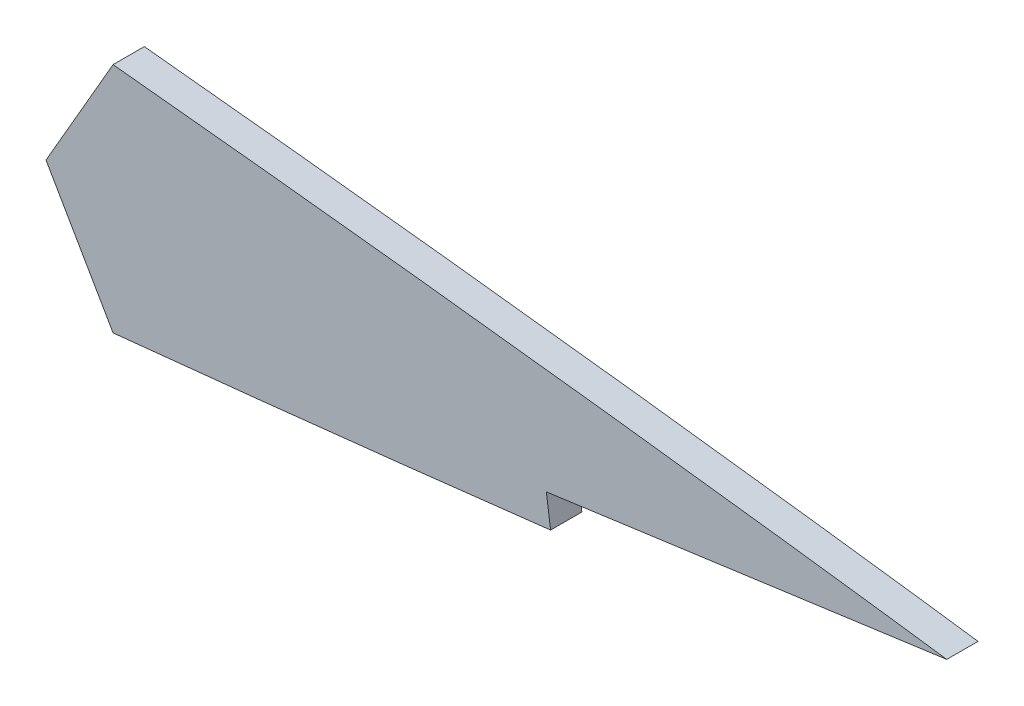
ISO-10303-21;
HEADER;
FILE_DESCRIPTION(('STEP AP214'),'2;1');
FILE_NAME('part.step','',(''),(''),'','','');
FILE_SCHEMA(('AUTOMOTIVE_DESIGN { 1 0 10303 214 1 1 1 1 }'));
ENDSEC;
DATA;
#1=APPLICATION_CONTEXT('core data for automotive mechanical design processes');
#2=APPLICATION_PROTOCOL_DEFINITION('international standard','automotive_design',2000,#1);
#3=PRODUCT_CONTEXT('',#1,'mechanical');
#4=PRODUCT('Part','Part','',(#3));
#5=PRODUCT_RELATED_PRODUCT_CATEGORY('part','',(#4));
#6=PRODUCT_DEFINITION_FORMATION('','',#4);
#7=PRODUCT_DEFINITION_CONTEXT('part definition',#1,'design');
#8=PRODUCT_DEFINITION('design','',#6,#7);
#9=PRODUCT_DEFINITION_SHAPE('','',#8);
#10=(LENGTH_UNIT() NAMED_UNIT(*) SI_UNIT(.MILLI.,.METRE.));
#11=(NAMED_UNIT(*) PLANE_ANGLE_UNIT() SI_UNIT($,.RADIAN.));
#12=(NAMED_UNIT(*) SI_UNIT($,.STERADIAN.) SOLID_ANGLE_UNIT());
#13=UNCERTAINTY_MEASURE_WITH_UNIT(LENGTH_MEASURE(1.E-05),#10,'distance_accuracy_value','');
#14=(GEOMETRIC_REPRESENTATION_CONTEXT(3) GLOBAL_UNCERTAINTY_ASSIGNED_CONTEXT((#13)) GLOBAL_UNIT_ASSIGNED_CONTEXT((#10,
#11,#12)) REPRESENTATION_CONTEXT('',''));
#15=CARTESIAN_POINT('',(0.,0.,0.));
#16=DIRECTION('',(0.,0.,1.));
#17=DIRECTION('',(1.,0.,0.));
#18=AXIS2_PLACEMENT_3D('',#15,#16,#17);
#19=CARTESIAN_POINT('',(0.,0.,3.175));
#20=CARTESIAN_POINT('',(0.11598553480206,-0.824823436018305,3.175));
#21=CARTESIAN_POINT('',(0.364862543708602,-2.59469577382463,3.175));
#22=CARTESIAN_POINT('',(2.22969317329404,-4.97424741823603,3.175));
#23=CARTESIAN_POINT('',(4.98137123964954,-7.17476356535342,3.175));
#24=CARTESIAN_POINT('',(8.77294159508804,-9.24947970106576,3.175));
#25=CARTESIAN_POINT('',(13.5435191774407,-11.2024906751345,3.175));
#26=CARTESIAN_POINT('',(19.2974960213887,-13.0205834501878,3.175));
#27=CARTESIAN_POINT('',(25.9988683661861,-14.6868250170778,3.175));
#28=CARTESIAN_POINT('',(33.6118170782071,-16.1849674426803,3.175));
#29=CARTESIAN_POINT('',(42.0909888876184,-17.4980708306289,3.175));
#30=CARTESIAN_POINT('',(51.3852334657117,-18.6124209383249,3.175));
#31=CARTESIAN_POINT('',(61.4378279271614,-19.5185362955799,3.175));
#32=CARTESIAN_POINT('',(72.1872792194382,-20.2093401026352,3.175));
#33=CARTESIAN_POINT('',(83.5675143626099,-20.6827537764749,3.175));
#34=CARTESIAN_POINT('',(95.5084877266096,-20.9400156934708,3.175));
#35=CARTESIAN_POINT('',(107.936696619066,-20.9876471619784,3.175));
#36=CARTESIAN_POINT('',(120.775518049418,-20.8348485852232,3.175));
#37=CARTESIAN_POINT('',(133.946062727329,-20.4937461228791,3.175));
#38=CARTESIAN_POINT('',(147.366939386786,-19.981000511003,3.175));
#39=CARTESIAN_POINT('',(160.955791029869,-19.3133394364877,3.175));
#40=CARTESIAN_POINT('',(174.628693343563,-18.508566702671,3.175));
#41=CARTESIAN_POINT('',(188.301472832485,-17.5870138793066,3.175));
#42=CARTESIAN_POINT('',(201.889886046072,-16.5679498364445,3.175));
#43=CARTESIAN_POINT('',(215.310032455186,-15.470294327225,3.175));
#44=CARTESIAN_POINT('',(228.479451099162,-14.3119446099029,3.175));
#45=CARTESIAN_POINT('',(241.316804274559,-13.1122664299753,3.175));
#46=CARTESIAN_POINT('',(253.743033604296,-11.887008330919,3.175));
#47=CARTESIAN_POINT('',(265.681494766393,-10.6533719228195,3.175));
#48=CARTESIAN_POINT('',(277.058607360279,-9.42727111028594,3.175));
#49=CARTESIAN_POINT('',(287.804163994382,-8.22396630077346,3.175));
#50=CARTESIAN_POINT('',(297.851820226782,-7.0580399063066,3.175));
#51=CARTESIAN_POINT('',(307.139892382437,-5.94572982998584,3.175));
#52=CARTESIAN_POINT('',(315.610665982134,-4.89963732621521,3.175));
#53=CARTESIAN_POINT('',(323.213152208341,-3.93775159154104,3.175));
#54=CARTESIAN_POINT('',(329.896669994559,-3.064968775534,3.175));
#55=CARTESIAN_POINT('',(335.63166517205,-2.31918990164751,3.175));
#56=CARTESIAN_POINT('',(340.34887380594,-1.64076533548796,3.175));
#57=CARTESIAN_POINT('',(344.110866429769,-1.23133082569655,3.175));
#58=CARTESIAN_POINT('',(346.670763267733,-0.635287814967107,3.175));
#59=CARTESIAN_POINT('',(348.546486747565,-0.815947966453894,3.175));
#60=CARTESIAN_POINT('',(349.081845345648,-0.195028946210061,3.175));
#61=CARTESIAN_POINT('',(349.25,0.,3.175));
#62=B_SPLINE_CURVE_WITH_KNOTS('',3,(#19,#20,#21,#22,#23,#24,#25,#26,#27,#28,#29,#30,#31,#32,#33,
#34,#35,#36,#37,#38,#39,#40,#41,#42,#43,#44,#45,#46,#47,#48,#49,#50,#51,#52,#53,#54,#55,#56,#57,
#58,#59,#60,#61),.UNSPECIFIED.,.F.,.F.,(4,1,1,1,1,1,1,1,1,1,1,1,1,1,1,1,1,1,1,1,1,1,1,1,1,1,1,1,
1,1,1,1,1,1,1,1,1,1,1,1,4),(0.,0.00690887819095132,0.014824787780603,0.0245786747262124,
0.0365868011412138,0.0510270804082164,0.0679537271803132,0.0873481546665464,0.109150934661929,
0.133267944172764,0.159584673072264,0.187963463690011,0.218251704826384,0.250281930400473,
0.283870156733695,0.318821997747217,0.354933688380441,0.391987367731552,0.429762919657396,
0.468028540529623,0.506552783072523,0.545097780862577,0.583424682124698,0.621298850837664,
0.658483139040777,0.694749649104267,0.72987052691746,0.763629321442605,0.795816346106627,
0.826229711631338,0.85468110230924,0.880993609524026,0.90500122422466,0.92655519067439,
0.945518651994912,0.961773354231409,0.975215057817464,0.985759966117311,0.993340110835715,
0.997908147241042,1.),.UNSPECIFIED.);
#63=DIRECTION('',(0.,0.,-1.));
#64=VECTOR('',#63,1.);
#65=SURFACE_OF_LINEAR_EXTRUSION('',#62,#64);
#66=CARTESIAN_POINT('',(254.465257242825,-11.8043718112123,3.175));
#67=VERTEX_POINT('',#66);
#68=CARTESIAN_POINT('',(298.924272590697,-6.92539967977461,3.175));
#69=VERTEX_POINT('',#68);
#70=EDGE_CURVE('E112',#67,#69,#62,.T.);
#71=ORIENTED_EDGE('',*,*,#70,.F.);
#72=DIRECTION('',(0.,0.,1.));
#73=VECTOR('',#72,1.);
#74=CARTESIAN_POINT('',(254.465257242825,-11.8043718112123,-1.905));
#75=LINE('',#74,#73);
#76=CARTESIAN_POINT('',(254.465257242825,-11.8043718112123,0.));
#77=VERTEX_POINT('',#76);
#78=EDGE_CURVE('E96',#77,#67,#75,.T.);
#79=ORIENTED_EDGE('',*,*,#78,.F.);
#80=CARTESIAN_POINT('',(0.,0.,0.));
#81=CARTESIAN_POINT('',(0.11598553480206,-0.824823436018305,0.));
#82=CARTESIAN_POINT('',(0.364862543708602,-2.59469577382463,0.));
#83=CARTESIAN_POINT('',(2.22969317329404,-4.97424741823603,0.));
#84=CARTESIAN_POINT('',(4.98137123964954,-7.17476356535342,0.));
#85=CARTESIAN_POINT('',(8.77294159508804,-9.24947970106576,0.));
#86=CARTESIAN_POINT('',(13.5435191774407,-11.2024906751345,0.));
#87=CARTESIAN_POINT('',(19.2974960213887,-13.0205834501878,0.));
#88=CARTESIAN_POINT('',(25.9988683661861,-14.6868250170778,0.));
#89=CARTESIAN_POINT('',(33.6118170782071,-16.1849674426803,0.));
#90=CARTESIAN_POINT('',(42.0909888876184,-17.4980708306289,0.));
#91=CARTESIAN_POINT('',(51.3852334657117,-18.6124209383249,0.));
#92=CARTESIAN_POINT('',(61.4378279271614,-19.5185362955799,0.));
#93=CARTESIAN_POINT('',(72.1872792194382,-20.2093401026352,0.));
#94=CARTESIAN_POINT('',(83.5675143626099,-20.6827537764749,0.));
#95=CARTESIAN_POINT('',(95.5084877266096,-20.9400156934708,0.));
#96=CARTESIAN_POINT('',(107.936696619066,-20.9876471619784,0.));
#97=CARTESIAN_POINT('',(120.775518049418,-20.8348485852232,0.));
#98=CARTESIAN_POINT('',(133.946062727329,-20.4937461228791,0.));
#99=CARTESIAN_POINT('',(147.366939386786,-19.981000511003,0.));
#100=CARTESIAN_POINT('',(160.955791029869,-19.3133394364877,0.));
#101=CARTESIAN_POINT('',(174.628693343563,-18.508566702671,0.));
#102=CARTESIAN_POINT('',(188.301472832485,-17.5870138793066,0.));
#103=CARTESIAN_POINT('',(201.889886046072,-16.5679498364445,0.));
#104=CARTESIAN_POINT('',(215.310032455186,-15.470294327225,0.));
#105=CARTESIAN_POINT('',(228.479451099162,-14.3119446099029,0.));
#106=CARTESIAN_POINT('',(241.316804274559,-13.1122664299753,0.));
#107=CARTESIAN_POINT('',(253.743033604296,-11.887008330919,0.));
#108=CARTESIAN_POINT('',(265.681494766393,-10.6533719228195,0.));
#109=CARTESIAN_POINT('',(277.058607360279,-9.42727111028594,0.));
#110=CARTESIAN_POINT('',(287.804163994382,-8.22396630077346,0.));
#111=CARTESIAN_POINT('',(297.851820226782,-7.0580399063066,0.));
#112=CARTESIAN_POINT('',(307.139892382437,-5.94572982998584,0.));
#113=CARTESIAN_POINT('',(315.610665982134,-4.89963732621521,0.));
#114=CARTESIAN_POINT('',(323.213152208341,-3.93775159154104,0.));
#115=CARTESIAN_POINT('',(329.896669994559,-3.064968775534,0.));
#116=CARTESIAN_POINT('',(335.63166517205,-2.31918990164751,0.));
#117=CARTESIAN_POINT('',(340.34887380594,-1.64076533548796,0.));
#118=CARTESIAN_POINT('',(344.110866429769,-1.23133082569655,0.));
#119=CARTESIAN_POINT('',(346.670763267733,-0.635287814967107,0.));
#120=CARTESIAN_POINT('',(348.546486747565,-0.815947966453894,0.));
#121=CARTESIAN_POINT('',(349.081845345648,-0.195028946210061,0.));
#122=CARTESIAN_POINT('',(349.25,0.,0.));
#123=B_SPLINE_CURVE_WITH_KNOTS('',3,(#80,#81,#82,#83,#84,#85,#86,#87,#88,#89,#90,#91,#92,#93,
#94,#95,#96,#97,#98,#99,#100,#101,#102,#103,#104,#105,#106,#107,#108,#109,#110,#111,#112,#113,
#114,#115,#116,#117,#118,#119,#120,#121,#122),.UNSPECIFIED.,.F.,.F.,(4,1,1,1,1,1,1,1,1,1,1,1,1,
1,1,1,1,1,1,1,1,1,1,1,1,1,1,1,1,1,1,1,1,1,1,1,1,1,1,1,4),(0.,0.00690887819095132,
0.014824787780603,0.0245786747262124,0.0365868011412138,0.0510270804082164,0.0679537271803132,
0.0873481546665464,0.109150934661929,0.133267944172764,0.159584673072264,0.187963463690011,
0.218251704826384,0.250281930400473,0.283870156733695,0.318821997747217,0.354933688380441,
0.391987367731552,0.429762919657396,0.468028540529623,0.506552783072523,0.545097780862577,
0.583424682124698,0.621298850837664,0.658483139040777,0.694749649104267,0.72987052691746,
0.763629321442605,0.795816346106627,0.826229711631338,0.85468110230924,0.880993609524026,
0.90500122422466,0.92655519067439,0.945518651994912,0.961773354231409,0.975215057817464,
0.985759966117311,0.993340110835715,0.997908147241042,1.),.UNSPECIFIED.);
#124=CARTESIAN_POINT('',(298.924272590697,-6.92539967977461,0.));
#125=VERTEX_POINT('',#124);
#126=EDGE_CURVE('E122',#77,#125,#123,.T.);
#127=ORIENTED_EDGE('',*,*,#126,.T.);
#128=DIRECTION('',(0.,0.,-1.));
#129=VECTOR('',#128,1.);
#130=CARTESIAN_POINT('',(298.924272590672,-6.92539967959393,3.175));
#131=LINE('',#130,#129);
#132=EDGE_CURVE('E116',#125,#69,#131,.F.);
#133=ORIENTED_EDGE('',*,*,#132,.T.);
#134=EDGE_LOOP('',(#71,#79,#127,#133));
#135=FACE_BOUND('',#134,.T.);
#136=ADVANCED_FACE('F45',(#135),#65,.F.);
#137=CARTESIAN_POINT('',(349.25,0.,3.175));
#138=CARTESIAN_POINT('',(349.081845345648,0.195028946210055,3.175));
#139=CARTESIAN_POINT('',(348.546486747565,0.815947966453887,3.175));
#140=CARTESIAN_POINT('',(346.670763267732,0.635287814967099,3.175));
#141=CARTESIAN_POINT('',(344.110866429769,1.23133082569654,3.175));
#142=CARTESIAN_POINT('',(340.34887380594,1.64076533548795,3.175));
#143=CARTESIAN_POINT('',(335.63166517205,2.3191899016475,3.175));
#144=CARTESIAN_POINT('',(329.896669994558,3.06496877553398,3.175));
#145=CARTESIAN_POINT('',(323.21315220834,3.93775159154102,3.175));
#146=CARTESIAN_POINT('',(315.610665982132,4.8996373262152,3.175));
#147=CARTESIAN_POINT('',(307.139892382437,5.94572982998583,3.175));
#148=CARTESIAN_POINT('',(297.851820226782,7.05803990630659,3.175));
#149=CARTESIAN_POINT('',(287.804163994382,8.22396630077345,3.175));
#150=CARTESIAN_POINT('',(277.058607360279,9.42727111028591,3.175));
#151=CARTESIAN_POINT('',(265.681494766392,10.6533719228194,3.175));
#152=CARTESIAN_POINT('',(253.743033604295,11.887008330919,3.175));
#153=CARTESIAN_POINT('',(241.316804274558,13.1122664299753,3.175));
#154=CARTESIAN_POINT('',(228.479451099162,14.3119446099029,3.175));
#155=CARTESIAN_POINT('',(215.310032455185,15.470294327225,3.175));
#156=CARTESIAN_POINT('',(201.889886046071,16.5679498364445,3.175));
#157=CARTESIAN_POINT('',(188.301472832485,17.5870138793065,3.175));
#158=CARTESIAN_POINT('',(174.628693343563,18.5085667026709,3.175));
#159=CARTESIAN_POINT('',(160.955791029868,19.3133394364876,3.175));
#160=CARTESIAN_POINT('',(147.366939386786,19.9810005110029,3.175));
#161=CARTESIAN_POINT('',(133.946062727329,20.4937461228791,3.175));
#162=CARTESIAN_POINT('',(120.775518049417,20.8348485852231,3.175));
#163=CARTESIAN_POINT('',(107.936696619066,20.9876471619784,3.175));
#164=CARTESIAN_POINT('',(95.5084877266094,20.9400156934707,3.175));
#165=CARTESIAN_POINT('',(83.5675143626097,20.6827537764748,3.175));
#166=CARTESIAN_POINT('',(72.187279219438,20.2093401026351,3.175));
#167=CARTESIAN_POINT('',(61.4378279271613,19.5185362955799,3.175));
#168=CARTESIAN_POINT('',(51.3852334657117,18.6124209383248,3.175));
#169=CARTESIAN_POINT('',(42.0909888876182,17.4980708306289,3.175));
#170=CARTESIAN_POINT('',(33.611817078207,16.1849674426803,3.175));
#171=CARTESIAN_POINT('',(25.9988683661861,14.6868250170778,3.175));
#172=CARTESIAN_POINT('',(19.2974960213886,13.0205834501878,3.175));
#173=CARTESIAN_POINT('',(13.5435191774407,11.2024906751345,3.175));
#174=CARTESIAN_POINT('',(8.77294159508801,9.24947970106573,3.175));
#175=CARTESIAN_POINT('',(4.98137123964952,7.17476356535341,3.175));
#176=CARTESIAN_POINT('',(2.22969317329403,4.97424741823602,3.175));
#177=CARTESIAN_POINT('',(0.364862543708601,2.59469577382463,3.175));
#178=CARTESIAN_POINT('',(0.115985534802059,0.824823436018292,3.175));
#179=CARTESIAN_POINT('',(0.,0.,3.175));
#180=B_SPLINE_CURVE_WITH_KNOTS('',3,(#137,#138,#139,#140,#141,#142,#143,#144,#145,#146,#147,
#148,#149,#150,#151,#152,#153,#154,#155,#156,#157,#158,#159,#160,#161,#162,#163,#164,#165,#166,
#167,#168,#169,#170,#171,#172,#173,#174,#175,#176,#177,#178,#179),.UNSPECIFIED.,.F.,.F.,(4,1,1,
1,1,1,1,1,1,1,1,1,1,1,1,1,1,1,1,1,1,1,1,1,1,1,1,1,1,1,1,1,1,1,1,1,1,1,1,1,4),(0.,
0.00209185275895771,0.00665988916428452,0.0142400338826894,0.0247849421825357,
0.0382266457685912,0.0544813480050881,0.0734448093256102,0.0949987757753401,0.119006390475974,
0.14531889769076,0.173770288368662,0.204183653893373,0.236370678557395,0.27012947308254,
0.305250350895733,0.341516860959223,0.378701149162336,0.416575317875302,0.454902219137423,
0.493447216927477,0.531971459470377,0.570237080342604,0.608012632268448,0.645066311619559,
0.681178002252783,0.716129843266305,0.749718069599527,0.781748295173616,0.812036536309989,
0.840415326927736,0.866732055827236,0.890849065338071,0.912651845333454,0.932046272819687,
0.948972919591784,0.963413198858786,0.975421325273788,0.985175212219397,0.993091121809049,1.),.UNSPECIFIED.);
#181=DIRECTION('',(0.,0.,-1.));
#182=VECTOR('',#181,1.);
#183=SURFACE_OF_LINEAR_EXTRUSION('',#180,#182);
#184=CARTESIAN_POINT('',(349.25,0.,0.));
#185=CARTESIAN_POINT('',(349.081845345648,0.195028946210055,0.));
#186=CARTESIAN_POINT('',(348.546486747565,0.815947966453887,0.));
#187=CARTESIAN_POINT('',(346.670763267732,0.635287814967099,0.));
#188=CARTESIAN_POINT('',(344.110866429769,1.23133082569654,0.));
#189=CARTESIAN_POINT('',(340.34887380594,1.64076533548795,0.));
#190=CARTESIAN_POINT('',(335.63166517205,2.3191899016475,0.));
#191=CARTESIAN_POINT('',(329.896669994558,3.06496877553398,0.));
#192=CARTESIAN_POINT('',(323.21315220834,3.93775159154102,0.));
#193=CARTESIAN_POINT('',(315.610665982132,4.8996373262152,0.));
#194=CARTESIAN_POINT('',(307.139892382437,5.94572982998583,0.));
#195=CARTESIAN_POINT('',(297.851820226782,7.05803990630659,0.));
#196=CARTESIAN_POINT('',(287.804163994382,8.22396630077345,0.));
#197=CARTESIAN_POINT('',(277.058607360279,9.42727111028591,0.));
#198=CARTESIAN_POINT('',(265.681494766392,10.6533719228194,0.));
#199=CARTESIAN_POINT('',(253.743033604295,11.887008330919,0.));
#200=CARTESIAN_POINT('',(241.316804274558,13.1122664299753,0.));
#201=CARTESIAN_POINT('',(228.479451099162,14.3119446099029,0.));
#202=CARTESIAN_POINT('',(215.310032455185,15.470294327225,0.));
#203=CARTESIAN_POINT('',(201.889886046071,16.5679498364445,0.));
#204=CARTESIAN_POINT('',(188.301472832485,17.5870138793065,0.));
#205=CARTESIAN_POINT('',(174.628693343563,18.5085667026709,0.));
#206=CARTESIAN_POINT('',(160.955791029868,19.3133394364876,0.));
#207=CARTESIAN_POINT('',(147.366939386786,19.9810005110029,0.));
#208=CARTESIAN_POINT('',(133.946062727329,20.4937461228791,0.));
#209=CARTESIAN_POINT('',(120.775518049417,20.8348485852231,0.));
#210=CARTESIAN_POINT('',(107.936696619066,20.9876471619784,0.));
#211=CARTESIAN_POINT('',(95.5084877266094,20.9400156934707,0.));
#212=CARTESIAN_POINT('',(83.5675143626097,20.6827537764748,0.));
#213=CARTESIAN_POINT('',(72.187279219438,20.2093401026351,0.));
#214=CARTESIAN_POINT('',(61.4378279271613,19.5185362955799,0.));
#215=CARTESIAN_POINT('',(51.3852334657117,18.6124209383248,0.));
#216=CARTESIAN_POINT('',(42.0909888876182,17.4980708306289,0.));
#217=CARTESIAN_POINT('',(33.611817078207,16.1849674426803,0.));
#218=CARTESIAN_POINT('',(25.9988683661861,14.6868250170778,0.));
#219=CARTESIAN_POINT('',(19.2974960213886,13.0205834501878,0.));
#220=CARTESIAN_POINT('',(13.5435191774407,11.2024906751345,0.));
#221=CARTESIAN_POINT('',(8.77294159508801,9.24947970106573,0.));
#222=CARTESIAN_POINT('',(4.98137123964952,7.17476356535341,0.));
#223=CARTESIAN_POINT('',(2.22969317329403,4.97424741823602,0.));
#224=CARTESIAN_POINT('',(0.364862543708601,2.59469577382463,0.));
#225=CARTESIAN_POINT('',(0.115985534802059,0.824823436018292,0.));
#226=CARTESIAN_POINT('',(0.,0.,0.));
#227=B_SPLINE_CURVE_WITH_KNOTS('',3,(#184,#185,#186,#187,#188,#189,#190,#191,#192,#193,#194,
#195,#196,#197,#198,#199,#200,#201,#202,#203,#204,#205,#206,#207,#208,#209,#210,#211,#212,#213,
#214,#215,#216,#217,#218,#219,#220,#221,#222,#223,#224,#225,#226),.UNSPECIFIED.,.F.,.F.,(4,1,1,
1,1,1,1,1,1,1,1,1,1,1,1,1,1,1,1,1,1,1,1,1,1,1,1,1,1,1,1,1,1,1,1,1,1,1,1,1,4),(0.,
0.00209185275895771,0.00665988916428452,0.0142400338826894,0.0247849421825357,
0.0382266457685912,0.0544813480050881,0.0734448093256102,0.0949987757753401,0.119006390475974,
0.14531889769076,0.173770288368662,0.204183653893373,0.236370678557395,0.27012947308254,
0.305250350895733,0.341516860959223,0.378701149162336,0.416575317875302,0.454902219137423,
0.493447216927477,0.531971459470377,0.570237080342604,0.608012632268448,0.645066311619559,
0.681178002252783,0.716129843266305,0.749718069599527,0.781748295173616,0.812036536309989,
0.840415326927736,0.866732055827236,0.890849065338071,0.912651845333454,0.932046272819687,
0.948972919591784,0.963413198858786,0.975421325273788,0.985175212219397,0.993091121809049,1.),.UNSPECIFIED.);
#228=CARTESIAN_POINT('',(339.177225922732,1.81879166669933,0.));
#229=VERTEX_POINT('',#228);
#230=CARTESIAN_POINT('',(254.465257242825,11.8043718112122,0.));
#231=VERTEX_POINT('',#230);
#232=EDGE_CURVE('E118',#229,#231,#227,.T.);
#233=ORIENTED_EDGE('',*,*,#232,.T.);
#234=DIRECTION('',(0.,0.,1.));
#235=VECTOR('',#234,1.);
#236=CARTESIAN_POINT('',(254.465257242825,11.8043718112122,-1.905));
#237=LINE('',#236,#235);
#238=CARTESIAN_POINT('',(254.465257242825,11.8043718112122,3.175));
#239=VERTEX_POINT('',#238);
#240=EDGE_CURVE('E205',#231,#239,#237,.T.);
#241=ORIENTED_EDGE('',*,*,#240,.T.);
#242=CARTESIAN_POINT('',(339.177225922732,1.81879166669933,3.175));
#243=VERTEX_POINT('',#242);
#244=EDGE_CURVE('E117',#243,#239,#180,.T.);
#245=ORIENTED_EDGE('',*,*,#244,.F.);
#246=DIRECTION('',(0.,0.,-1.));
#247=VECTOR('',#246,1.);
#248=CARTESIAN_POINT('',(339.177225921524,1.81879166653302,3.175));
#249=LINE('',#248,#247);
#250=EDGE_CURVE('E207',#243,#229,#249,.T.);
#251=ORIENTED_EDGE('',*,*,#250,.T.);
#252=EDGE_LOOP('',(#233,#241,#245,#251));
#253=FACE_BOUND('',#252,.T.);
#254=ADVANCED_FACE('F141',(#253),#183,.F.);
#255=CARTESIAN_POINT('',(172.295032653064,-18.6346740274406,3.175));
#256=DIRECTION('',(0.,0.,1.));
#257=DIRECTION('',(1.,0.,0.));
#258=AXIS2_PLACEMENT_3D('',#255,#256,#257);
#259=PLANE('',#258);
#260=DIRECTION('',(0.500000000001307,0.866025403783684,0.));
#261=VECTOR('',#260,1.);
#262=CARTESIAN_POINT('',(247.649999999983,0.,3.175));
#263=LINE('',#262,#261);
#264=CARTESIAN_POINT('',(247.649999999983,0.,3.175));
#265=VERTEX_POINT('',#264);
#266=EDGE_CURVE('E106',#265,#239,#263,.T.);
#267=ORIENTED_EDGE('',*,*,#266,.F.);
#268=DIRECTION('',(-0.500000000001321,0.866025403783676,0.));
#269=VECTOR('',#268,1.);
#270=CARTESIAN_POINT('',(247.649999999983,0.,3.175));
#271=LINE('',#270,#269);
#272=EDGE_CURVE('E99',#67,#265,#271,.T.);
#273=ORIENTED_EDGE('',*,*,#272,.F.);
#274=ORIENTED_EDGE('',*,*,#70,.T.);
#275=DIRECTION('',(0.136326765346333,-0.990663925380452,0.));
#276=VECTOR('',#275,1.);
#277=CARTESIAN_POINT('',(299.357110070647,-10.0707576426769,3.175));
#278=LINE('',#277,#276);
#279=CARTESIAN_POINT('',(298.491435110698,-3.78004171651099,3.175));
#280=VERTEX_POINT('',#279);
#281=EDGE_CURVE('E211',#280,#69,#278,.T.);
#282=ORIENTED_EDGE('',*,*,#281,.F.);
#283=DIRECTION('',(-0.990663925380452,-0.136326765346334,0.));
#284=VECTOR('',#283,1.);
#285=CARTESIAN_POINT('',(298.491435110698,-3.78004171651099,3.175));
#286=LINE('',#285,#284);
#287=EDGE_CURVE('E213',#243,#280,#286,.T.);
#288=ORIENTED_EDGE('',*,*,#287,.F.);
#289=ORIENTED_EDGE('',*,*,#244,.T.);
#290=EDGE_LOOP('',(#267,#273,#274,#282,#288,#289));
#291=FACE_BOUND('',#290,.T.);
#292=ADVANCED_FACE('F110',(#291),#259,.T.);
#293=CARTESIAN_POINT('',(172.295032653064,-18.6346740274406,0.));
#294=DIRECTION('',(0.,0.,1.));
#295=DIRECTION('',(1.,0.,0.));
#296=AXIS2_PLACEMENT_3D('',#293,#294,#295);
#297=PLANE('',#296);
#298=DIRECTION('',(-0.500000000001321,0.866025403783676,0.));
#299=VECTOR('',#298,1.);
#300=CARTESIAN_POINT('',(236.880308712671,18.6536524913912,0.));
#301=LINE('',#300,#299);
#302=CARTESIAN_POINT('',(247.649999999983,0.,0.));
#303=VERTEX_POINT('',#302);
#304=EDGE_CURVE('E53',#77,#303,#301,.T.);
#305=ORIENTED_EDGE('',*,*,#304,.T.);
#306=DIRECTION('',(0.500000000001307,0.866025403783684,0.));
#307=VECTOR('',#306,1.);
#308=CARTESIAN_POINT('',(220.742207613638,-46.6056635325026,0.));
#309=LINE('',#308,#307);
#310=EDGE_CURVE('E11',#303,#231,#309,.T.);
#311=ORIENTED_EDGE('',*,*,#310,.T.);
#312=ORIENTED_EDGE('',*,*,#232,.F.);
#313=DIRECTION('',(-0.990663925380452,-0.136326765346334,0.));
#314=VECTOR('',#313,1.);
#315=CARTESIAN_POINT('',(172.634213507578,-21.0994448733796,0.));
#316=LINE('',#315,#314);
#317=CARTESIAN_POINT('',(298.491435110698,-3.78004171651098,0.));
#318=VERTEX_POINT('',#317);
#319=EDGE_CURVE('E119',#229,#318,#316,.T.);
#320=ORIENTED_EDGE('',*,*,#319,.T.);
#321=DIRECTION('',(0.136326765346333,-0.990663925380452,0.));
#322=VECTOR('',#321,1.);
#323=CARTESIAN_POINT('',(298.152254256184,-1.31527087057218,0.));
#324=LINE('',#323,#322);
#325=EDGE_CURVE('E220',#318,#125,#324,.T.);
#326=ORIENTED_EDGE('',*,*,#325,.T.);
#327=ORIENTED_EDGE('',*,*,#126,.F.);
#328=EDGE_LOOP('',(#305,#311,#312,#320,#326,#327));
#329=FACE_BOUND('',#328,.T.);
#330=ADVANCED_FACE('F145',(#329),#297,.F.);
#331=CARTESIAN_POINT('',(299.357110070647,-10.0707576426769,-1.905));
#332=DIRECTION('',(-0.990663925380452,-0.136326765346333,0.));
#333=DIRECTION('',(0.136326765346333,-0.990663925380452,0.));
#334=AXIS2_PLACEMENT_3D('',#331,#332,#333);
#335=PLANE('',#334);
#336=ORIENTED_EDGE('',*,*,#325,.F.);
#337=DIRECTION('',(0.,0.,1.));
#338=VECTOR('',#337,1.);
#339=CARTESIAN_POINT('',(298.491435110698,-3.78004171651099,-1.905));
#340=LINE('',#339,#338);
#341=EDGE_CURVE('E68',#318,#280,#340,.T.);
#342=ORIENTED_EDGE('',*,*,#341,.T.);
#343=ORIENTED_EDGE('',*,*,#281,.T.);
#344=ORIENTED_EDGE('',*,*,#132,.F.);
#345=EDGE_LOOP('',(#336,#342,#343,#344));
#346=FACE_BOUND('',#345,.T.);
#347=ADVANCED_FACE('F148',(#346),#335,.F.);
#348=CARTESIAN_POINT('',(298.491435110698,-3.78004171651099,-1.905));
#349=DIRECTION('',(-0.136326765346334,0.990663925380452,0.));
#350=DIRECTION('',(-0.990663925380452,-0.136326765346334,0.));
#351=AXIS2_PLACEMENT_3D('',#348,#349,#350);
#352=PLANE('',#351);
#353=ORIENTED_EDGE('',*,*,#287,.T.);
#354=ORIENTED_EDGE('',*,*,#341,.F.);
#355=ORIENTED_EDGE('',*,*,#319,.F.);
#356=ORIENTED_EDGE('',*,*,#250,.F.);
#357=EDGE_LOOP('',(#353,#354,#355,#356));
#358=FACE_BOUND('',#357,.T.);
#359=ADVANCED_FACE('F154',(#358),#352,.F.);
#360=CARTESIAN_POINT('',(247.649999999983,0.,-1.905));
#361=DIRECTION('',(0.866025403783684,-0.500000000001307,0.));
#362=DIRECTION('',(0.500000000001307,0.866025403783684,0.));
#363=AXIS2_PLACEMENT_3D('',#360,#361,#362);
#364=PLANE('',#363);
#365=DIRECTION('',(0.,0.,1.));
#366=VECTOR('',#365,1.);
#367=CARTESIAN_POINT('',(247.649999999983,0.,-1.905));
#368=LINE('',#367,#366);
#369=EDGE_CURVE('E60',#303,#265,#368,.T.);
#370=ORIENTED_EDGE('',*,*,#369,.T.);
#371=ORIENTED_EDGE('',*,*,#266,.T.);
#372=ORIENTED_EDGE('',*,*,#240,.F.);
#373=ORIENTED_EDGE('',*,*,#310,.F.);
#374=EDGE_LOOP('',(#370,#371,#372,#373));
#375=FACE_BOUND('',#374,.T.);
#376=ADVANCED_FACE('F158',(#375),#364,.F.);
#377=CARTESIAN_POINT('',(247.649999999983,0.,-1.905));
#378=DIRECTION('',(0.866025403783676,0.500000000001321,0.));
#379=DIRECTION('',(-0.500000000001321,0.866025403783676,0.));
#380=AXIS2_PLACEMENT_3D('',#377,#378,#379);
#381=PLANE('',#380);
#382=ORIENTED_EDGE('',*,*,#78,.T.);
#383=ORIENTED_EDGE('',*,*,#272,.T.);
#384=ORIENTED_EDGE('',*,*,#369,.F.);
#385=ORIENTED_EDGE('',*,*,#304,.F.);
#386=EDGE_LOOP('',(#382,#383,#384,#385));
#387=FACE_BOUND('',#386,.T.);
#388=ADVANCED_FACE('F98',(#387),#381,.F.);
#389=CLOSED_SHELL('',(#136,#254,#292,#330,#347,#359,#376,#388));
#390=MANIFOLD_SOLID_BREP('B2',#389);
#391=ADVANCED_BREP_SHAPE_REPRESENTATION('',(#18,#390),#14);
#392=SHAPE_DEFINITION_REPRESENTATION(#9,#391);
ENDSEC;
END-ISO-10303-21;
